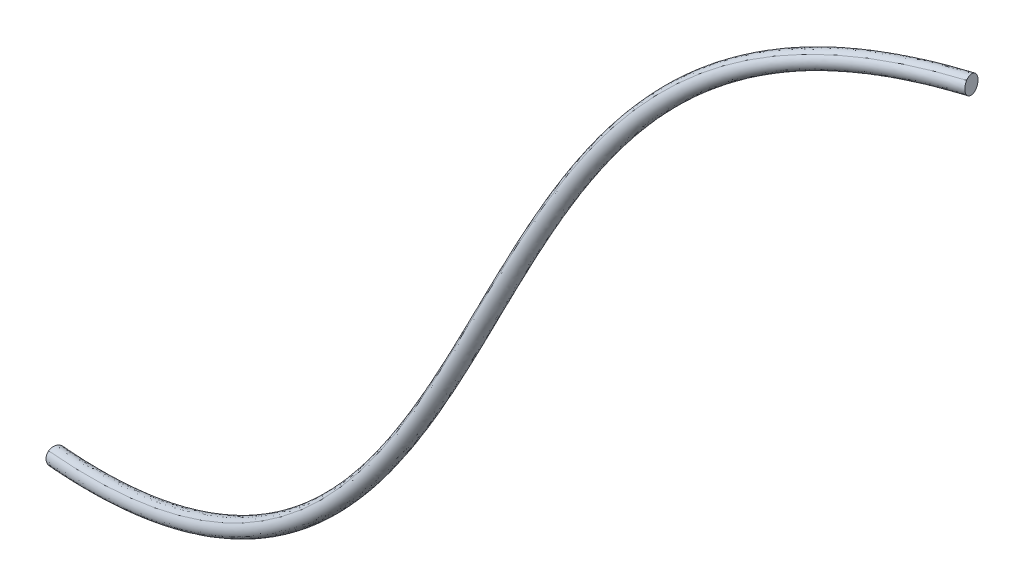
ISO-10303-21;
HEADER;
FILE_DESCRIPTION(('STEP AP214'),'2;1');
FILE_NAME('part.step','',(''),(''),'','','');
FILE_SCHEMA(('AUTOMOTIVE_DESIGN { 1 0 10303 214 1 1 1 1 }'));
ENDSEC;
DATA;
#1=APPLICATION_CONTEXT('core data for automotive mechanical design processes');
#2=APPLICATION_PROTOCOL_DEFINITION('international standard','automotive_design',2000,#1);
#3=PRODUCT_CONTEXT('',#1,'mechanical');
#4=PRODUCT('Part','Part','',(#3));
#5=PRODUCT_RELATED_PRODUCT_CATEGORY('part','',(#4));
#6=PRODUCT_DEFINITION_FORMATION('','',#4);
#7=PRODUCT_DEFINITION_CONTEXT('part definition',#1,'design');
#8=PRODUCT_DEFINITION('design','',#6,#7);
#9=PRODUCT_DEFINITION_SHAPE('','',#8);
#10=(LENGTH_UNIT() NAMED_UNIT(*) SI_UNIT(.MILLI.,.METRE.));
#11=(NAMED_UNIT(*) PLANE_ANGLE_UNIT() SI_UNIT($,.RADIAN.));
#12=(NAMED_UNIT(*) SI_UNIT($,.STERADIAN.) SOLID_ANGLE_UNIT());
#13=UNCERTAINTY_MEASURE_WITH_UNIT(LENGTH_MEASURE(1.E-05),#10,'distance_accuracy_value','');
#14=(GEOMETRIC_REPRESENTATION_CONTEXT(3) GLOBAL_UNCERTAINTY_ASSIGNED_CONTEXT((#13)) GLOBAL_UNIT_ASSIGNED_CONTEXT((#10,
#11,#12)) REPRESENTATION_CONTEXT('',''));
#15=CARTESIAN_POINT('',(0.,0.,0.));
#16=DIRECTION('',(0.,0.,1.));
#17=DIRECTION('',(1.,0.,0.));
#18=AXIS2_PLACEMENT_3D('',#15,#16,#17);
#19=CARTESIAN_POINT('',(-33.6845032303222,79.1480566839275,-95.6289230354739));
#20=CARTESIAN_POINT('',(-34.5053723074152,81.6620351177427,-98.6299372611897));
#21=CARTESIAN_POINT('',(-34.3757825294135,77.3088553118633,-99.6463191124357));
#22=CARTESIAN_POINT('',(-33.5549134521635,74.7948768773692,-96.6453048857477));
#23=CARTESIAN_POINT('',(-32.8636341527265,76.634078248573,-92.6279088079205));
#24=CARTESIAN_POINT('',(-33.6845032303222,79.1480566839275,-95.6289230354739));
#25=CARTESIAN_POINT('',(-37.7318592800201,78.8310864410359,-94.7873765381933));
#26=CARTESIAN_POINT('',(-38.7044746509468,81.3331808071272,-97.7568389162217));
#27=CARTESIAN_POINT('',(-38.3267275887415,76.9994355314687,-98.8248188700412));
#28=CARTESIAN_POINT('',(-37.3541122176295,74.4973411646348,-95.855356491061));
#29=CARTESIAN_POINT('',(-36.7592439084979,76.3289920734125,-91.8179141583467));
#30=CARTESIAN_POINT('',(-37.7318592800201,78.8310864410359,-94.7873765381933));
#31=CARTESIAN_POINT('',(-41.760825570835,78.2100173409345,-93.9371937113666));
#32=CARTESIAN_POINT('',(-42.9084919137163,80.6868683451922,-96.8698561652652));
#33=CARTESIAN_POINT('',(-42.2444636953977,76.3942514519232,-97.9980130548442));
#34=CARTESIAN_POINT('',(-41.0967973481256,73.9174003962123,-95.065350618901));
#35=CARTESIAN_POINT('',(-40.6131592272509,75.7331663351602,-91.0045312556722));
#36=CARTESIAN_POINT('',(-41.760825570835,78.2100173409345,-93.9371937113666));
#37=CARTESIAN_POINT('',(-45.7618018282027,77.2199418263735,-93.0778004639287));
#38=CARTESIAN_POINT('',(-47.1133243003257,79.6518976854315,-95.9670660439208));
#39=CARTESIAN_POINT('',(-46.116016448665,75.4323682697077,-97.1661572660917));
#40=CARTESIAN_POINT('',(-44.7644939754256,73.0004124098136,-94.2768916825047));
#41=CARTESIAN_POINT('',(-44.4102793552521,74.7879859658263,-90.1885348821675));
#42=CARTESIAN_POINT('',(-45.7618018282027,77.2199418263735,-93.0778004639287));
#43=CARTESIAN_POINT('',(-53.1967781559469,74.4198379076141,-91.4408828401396));
#44=CARTESIAN_POINT('',(-54.987926366563,76.6882617787362,-94.2342349442603));
#45=CARTESIAN_POINT('',(-53.2696265324785,72.7341025090626,-95.5905185065432));
#46=CARTESIAN_POINT('',(-51.4784783219654,70.4656786373607,-92.7971664040392));
#47=CARTESIAN_POINT('',(-51.405629944234,72.151414035103,-88.6475307343085));
#48=CARTESIAN_POINT('',(-53.1967781559469,74.4198379076141,-91.4408828401396));
#49=CARTESIAN_POINT('',(-59.7762762705285,69.9124458835433,-89.9214074181916));
#50=CARTESIAN_POINT('',(-61.9924252693158,71.8915873915695,-92.6174733711643));
#51=CARTESIAN_POINT('',(-59.5666811276932,68.4159606416233,-94.1356029362958));
#52=CARTESIAN_POINT('',(-57.3505321275629,66.4368191329065,-91.4395369802412));
#53=CARTESIAN_POINT('',(-57.5601272703842,67.9333043743053,-87.225341463568));
#54=CARTESIAN_POINT('',(-59.7762762705285,69.9124458835433,-89.9214074181916));
#55=CARTESIAN_POINT('',(-62.6384747161083,67.3708941724311,-89.2425990879204));
#56=CARTESIAN_POINT('',(-65.0305938647348,69.1875015695673,-91.8968992124302));
#57=CARTESIAN_POINT('',(-62.3074502175798,65.9841675798163,-93.4855477078927));
#58=CARTESIAN_POINT('',(-59.9153310732129,64.1675601812705,-90.8312475834725));
#59=CARTESIAN_POINT('',(-60.246355566017,65.5542867741826,-86.5882989617852));
#60=CARTESIAN_POINT('',(-62.6384747161083,67.3708941724311,-89.2425990879204));
#61=CARTESIAN_POINT('',(-67.5009949547825,62.0172281365699,-88.0729138003455));
#62=CARTESIAN_POINT('',(-70.1440548385956,63.5501811273866,-90.6658441933193));
#63=CARTESIAN_POINT('',(-66.987207247298,60.8385437512397,-92.360628799866));
#64=CARTESIAN_POINT('',(-64.3441473581608,59.3055907607533,-89.767698405292));
#65=CARTESIAN_POINT('',(-64.857935069351,60.4842751448146,-85.479983405784));
#66=CARTESIAN_POINT('',(-67.5009949547825,62.0172281365699,-88.0729138003455));
#67=CARTESIAN_POINT('',(-71.4720557087035,55.9799943435315,-87.1329947680128));
#68=CARTESIAN_POINT('',(-74.2443546919099,57.3138121060511,-89.6921386574925));
#69=CARTESIAN_POINT('',(-70.8466507689906,54.9850665433518,-91.4495712022842));
#70=CARTESIAN_POINT('',(-68.0743517889575,53.6512487797411,-88.8904273127177));
#71=CARTESIAN_POINT('',(-68.6997567237996,54.6461765801952,-84.573850876966));
#72=CARTESIAN_POINT('',(-71.4720557087035,55.9799943435315,-87.1329947680128));
#73=CARTESIAN_POINT('',(-73.1850031945781,53.0383003549128,-86.7413958319725));
#74=CARTESIAN_POINT('',(-75.9966036597975,54.3049067314083,-89.289840111908));
#75=CARTESIAN_POINT('',(-72.5198535930407,52.1198359821293,-91.0683922128712));
#76=CARTESIAN_POINT('',(-69.7082531296406,50.8532296058757,-88.519947932717));
#77=CARTESIAN_POINT('',(-70.3734027276371,51.7716939776417,-84.1929515504765));
#78=CARTESIAN_POINT('',(-73.1850031945781,53.0383003549128,-86.7413958319725));
#79=CARTESIAN_POINT('',(-76.536731781197,46.7869063065785,-86.0250146919366));
#80=CARTESIAN_POINT('',(-79.399783115895,47.9641322917615,-88.5586944004373));
#81=CARTESIAN_POINT('',(-75.8050396619757,46.0086877838585,-90.3690577452818));
#82=CARTESIAN_POINT('',(-72.9419883235012,44.8314617975262,-87.83537803544));
#83=CARTESIAN_POINT('',(-73.6736804447458,45.6096803206747,-83.4913349818845));
#84=CARTESIAN_POINT('',(-76.536731781197,46.7869063065785,-86.0250146919366));
#85=CARTESIAN_POINT('',(-79.6109495533538,40.4026320531771,-85.5151514735015));
#86=CARTESIAN_POINT('',(-82.469482798476,41.5922965520514,-88.047390366344));
#87=CARTESIAN_POINT('',(-78.8353684553753,39.7274610551557,-89.8679530440442));
#88=CARTESIAN_POINT('',(-75.9768352126377,38.5377965566711,-87.3357141511));
#89=CARTESIAN_POINT('',(-76.7524163064813,39.2129675535743,-82.9829125791085));
#90=CARTESIAN_POINT('',(-79.6109495533538,40.4026320531771,-85.5151514735015));
#91=CARTESIAN_POINT('',(-81.2020489152879,37.0573967606762,-85.3032791011795));
#92=CARTESIAN_POINT('',(-84.0458726875682,38.2795125657242,-87.8375263156273));
#93=CARTESIAN_POINT('',(-80.4058935790862,36.427115088456,-89.6589328742075));
#94=CARTESIAN_POINT('',(-77.5620698057757,35.2049992844572,-87.1246856579405));
#95=CARTESIAN_POINT('',(-78.3582251412662,35.8352809548799,-82.76903188518));
#96=CARTESIAN_POINT('',(-81.2020489152879,37.0573967606762,-85.3032791011795));
#97=CARTESIAN_POINT('',(-84.6021600073528,30.0896558093534,-84.9760687249549));
#98=CARTESIAN_POINT('',(-87.3863254709585,31.4309928202342,-87.5200980553603));
#99=CARTESIAN_POINT('',(-83.7627378384492,29.5368746726278,-89.334236661248));
#100=CARTESIAN_POINT('',(-80.9785723742065,28.1955376597728,-86.7902073310605));
#101=CARTESIAN_POINT('',(-81.8179945420423,28.7483187976512,-82.4320393929918));
#102=CARTESIAN_POINT('',(-84.6021600073528,30.0896558093534,-84.9760687249549));
#103=CARTESIAN_POINT('',(-88.338580293266,23.3124406707113,-84.9080610109557));
#104=CARTESIAN_POINT('',(-90.990374671308,24.8662856953991,-87.4736312577017));
#105=CARTESIAN_POINT('',(-87.4466836169637,22.8009470679924,-89.2605816296007));
#106=CARTESIAN_POINT('',(-84.7948892378617,21.2471020446523,-86.695011380895));
#107=CARTESIAN_POINT('',(-85.6867859136002,21.758595645072,-82.3424907626387));
#108=CARTESIAN_POINT('',(-88.338580293266,23.3124406707113,-84.9080610109557));
#109=CARTESIAN_POINT('',(-90.4437843932474,19.8507125766429,-84.9478842998231));
#110=CARTESIAN_POINT('',(-93.0029159547427,21.5372305523186,-87.5279681740075));
#111=CARTESIAN_POINT('',(-89.519389211958,19.3506651775969,-89.2949677165145));
#112=CARTESIAN_POINT('',(-86.9602576482985,17.6641471995422,-86.7148838383625));
#113=CARTESIAN_POINT('',(-87.884652830185,18.1641945999345,-82.3678004240588));
#114=CARTESIAN_POINT('',(-90.4437843932474,19.8507125766429,-84.9478842998231));
#115=CARTESIAN_POINT('',(-95.4858524735816,12.5499389351737,-85.2166070464577));
#116=CARTESIAN_POINT('',(-97.7737679470863,14.5597152609863,-87.8367975029275));
#117=CARTESIAN_POINT('',(-94.4752459501862,12.043706270219,-89.544419988054));
#118=CARTESIAN_POINT('',(-92.187330477695,10.0339299459518,-86.924229534588));
#119=CARTESIAN_POINT('',(-93.197936998676,10.5401626081305,-82.5964165883835));
#120=CARTESIAN_POINT('',(-95.4858524735816,12.5499389351737,-85.2166070464577));
#121=CARTESIAN_POINT('',(-101.557276887098,6.12770272325862,-85.9000100443528));
#122=CARTESIAN_POINT('',(-103.426450048395,8.46719266417557,-88.5774344865732));
#123=CARTESIAN_POINT('',(-100.443444023573,5.52829260011018,-90.190690361982));
#124=CARTESIAN_POINT('',(-98.57427085965,3.18880265572066,-87.51326591427));
#125=CARTESIAN_POINT('',(-99.6881037246567,3.78821278090915,-83.222585600493));
#126=CARTESIAN_POINT('',(-101.557276887098,6.12770272325862,-85.9000100443528));
#127=CARTESIAN_POINT('',(-105.18643098945,2.99462321745921,-86.399333386397));
#128=CARTESIAN_POINT('',(-106.783822140051,5.49119854572251,-89.1126506556722));
#129=CARTESIAN_POINT('',(-104.016824647343,2.31116485157093,-90.663787437363));
#130=CARTESIAN_POINT('',(-102.41943349694,-0.185410480765234,-87.9504701719255));
#131=CARTESIAN_POINT('',(-103.589039837871,0.498047887667206,-83.6860161154602));
#132=CARTESIAN_POINT('',(-105.18643098945,2.99462321745921,-86.399333386397));
#133=CARTESIAN_POINT('',(-113.736288937573,-2.93320381253314,-87.7448420434316));
#134=CARTESIAN_POINT('',(-114.713775389148,-0.198621524594232,-90.5400665054792));
#135=CARTESIAN_POINT('',(-112.486966536521,-3.85820577370835,-91.9437936616002));
#136=CARTESIAN_POINT('',(-111.509480083745,-6.59278805862435,-89.1485691931843));
#137=CARTESIAN_POINT('',(-112.7588024854,-5.66778610214648,-84.9496175796725));
#138=CARTESIAN_POINT('',(-113.736288937573,-2.93320381253314,-87.7448420434316));
#139=CARTESIAN_POINT('',(-123.298245146726,-6.90919527936296,-89.5424167310865));
#140=CARTESIAN_POINT('',(-123.704508284976,-4.13115469502926,-92.4152003194287));
#141=CARTESIAN_POINT('',(-122.066544831865,-8.1240645470182,-93.671231850911));
#142=CARTESIAN_POINT('',(-121.660281694491,-10.902105136731,-90.798448268206));
#143=CARTESIAN_POINT('',(-122.891982008228,-9.6872358653977,-86.6696331409852));
#144=CARTESIAN_POINT('',(-123.298245146726,-6.90919527936296,-89.5424167310865));
#145=CARTESIAN_POINT('',(-128.667435860088,-8.50855457830133,-90.6154171100554));
#146=CARTESIAN_POINT('',(-128.814248543664,-5.75317971598601,-93.5248808505925));
#147=CARTESIAN_POINT('',(-127.475814982872,-9.86865982714717,-94.7093372125007));
#148=CARTESIAN_POINT('',(-127.329002728242,-12.6240346020668,-91.7998737252012));
#149=CARTESIAN_POINT('',(-128.520623176422,-11.2639294423038,-87.7059533677368));
#150=CARTESIAN_POINT('',(-128.667435860088,-8.50855457830133,-90.6154171100554));
#151=CARTESIAN_POINT('',(-134.105809849165,-9.65339172389189,-91.7494854477227));
#152=CARTESIAN_POINT('',(-134.037210039855,-6.93632633400947,-94.6903035931578));
#153=CARTESIAN_POINT('',(-132.96527756936,-11.1379788671982,-95.8128077389448));
#154=CARTESIAN_POINT('',(-133.033877378711,-13.8550442577368,-92.871989592136));
#155=CARTESIAN_POINT('',(-134.174409658518,-12.370457115438,-88.8086673004868));
#156=CARTESIAN_POINT('',(-134.105809849165,-9.65339172389189,-91.7494854477227));
#157=CARTESIAN_POINT('',(-139.591278713323,-10.4198352991101,-92.9316734146425));
#158=CARTESIAN_POINT('',(-139.342045289605,-7.74969172886707,-95.8995372937403));
#159=CARTESIAN_POINT('',(-138.507652980239,-12.011376874184,-96.9681013751895));
#160=CARTESIAN_POINT('',(-138.756886403987,-14.6815204452339,-94.0002374951395));
#161=CARTESIAN_POINT('',(-139.840512137193,-13.0899788709881,-89.9638095337275));
#162=CARTESIAN_POINT('',(-139.591278713323,-10.4198352991101,-92.9316734146425));
#163=(BOUNDED_SURFACE() B_SPLINE_SURFACE(5,5,((#19,#20,#21,#22,#23,#24),(#25,#26,#27,#28,#29,
#30),(#31,#32,#33,#34,#35,#36),(#37,#38,#39,#40,#41,#42),(#43,#44,#45,#46,#47,#48),(#49,#50,#51,
#52,#53,#54),(#55,#56,#57,#58,#59,#60),(#61,#62,#63,#64,#65,#66),(#67,#68,#69,#70,#71,#72),(#73,
#74,#75,#76,#77,#78),(#79,#80,#81,#82,#83,#84),(#85,#86,#87,#88,#89,#90),(#91,#92,#93,#94,#95,
#96),(#97,#98,#99,#100,#101,#102),(#103,#104,#105,#106,#107,#108),(#109,#110,#111,#112,#113,
#114),(#115,#116,#117,#118,#119,#120),(#121,#122,#123,#124,#125,#126),(#127,#128,#129,#130,#131,
#132),(#133,#134,#135,#136,#137,#138),(#139,#140,#141,#142,#143,#144),(#145,#146,#147,#148,#149,
#150),(#151,#152,#153,#154,#155,#156),(#157,#158,#159,#160,#161,#162)),.UNSPECIFIED.,.F.,.T.,
.F.) B_SPLINE_SURFACE_WITH_KNOTS((6,3,3,3,3,3,3,6),(6,6),(0.,0.138277050661301,
0.266421728428524,0.38022589964879,0.505230602834062,0.642421974870507,0.806785834234992,1.),
(0.,1.),.UNSPECIFIED.) GEOMETRIC_REPRESENTATION_ITEM() RATIONAL_B_SPLINE_SURFACE(((1.,0.2,0.2,
0.2,0.2,1.),(1.,0.2,0.2,0.2,0.2,1.),(1.,0.2,0.2,0.2,0.2,1.),(1.,0.2,0.2,0.2,0.2,1.),(1.,0.2,0.2,
0.2,0.2,1.),(1.,0.2,0.2,0.2,0.2,1.),(1.,0.2,0.2,0.2,0.2,1.),(1.,0.2,0.2,0.2,0.2,1.),(1.,0.2,0.2,
0.2,0.2,1.),(1.,0.2,0.2,0.2,0.2,1.),(1.,0.2,0.2,0.2,0.2,1.),(1.,0.2,0.2,0.2,0.2,1.),(1.,0.2,0.2,
0.2,0.2,1.),(1.,0.2,0.2,0.2,0.2,1.),(1.,0.2,0.2,0.2,0.2,1.),(1.,0.2,0.2,0.2,0.2,1.),(1.,0.2,0.2,
0.2,0.2,1.),(1.,0.2,0.2,0.2,0.2,1.),(1.,0.2,0.2,0.2,0.2,1.),(1.,0.2,0.2,0.2,0.2,1.),(1.,0.2,0.2,
0.2,0.2,1.),(1.,0.2,0.2,0.2,0.2,1.),(1.,0.2,0.2,0.2,0.2,1.),(1.,0.2,0.2,0.2,0.2,1.))) REPRESENTATION_ITEM('') SURFACE());
#164=CARTESIAN_POINT('',(-139.591278713353,-10.4198352999419,-92.9316734137214));
#165=CARTESIAN_POINT('',(-134.105809849438,-9.65339172462634,-91.7494854467776));
#166=CARTESIAN_POINT('',(-128.667435824498,-8.50855449774803,-90.6154170649766));
#167=CARTESIAN_POINT('',(-123.298245147785,-6.90919527819959,-89.5424167285132));
#168=CARTESIAN_POINT('',(-113.736288936218,-2.93320381505569,-87.7448420440228));
#169=CARTESIAN_POINT('',(-105.186430989873,2.99462321815039,-86.3993333843165));
#170=CARTESIAN_POINT('',(-101.557276885727,6.12770272272741,-85.9000100460925));
#171=CARTESIAN_POINT('',(-95.4858524734683,12.5499389343762,-85.2166070434773));
#172=CARTESIAN_POINT('',(-90.4437843919303,19.8507125762994,-84.9478843008213));
#173=CARTESIAN_POINT('',(-88.3385802922195,23.3124406711138,-84.9080610100336));
#174=CARTESIAN_POINT('',(-84.602160006735,30.0896558080645,-84.9760687243127));
#175=CARTESIAN_POINT('',(-81.2020489142007,37.0573967611127,-85.3032791002773));
#176=CARTESIAN_POINT('',(-79.6109495515742,40.4026320522799,-85.5151514722814));
#177=CARTESIAN_POINT('',(-76.5367317811975,46.7869063067004,-86.0250146915647));
#178=CARTESIAN_POINT('',(-73.1850031929696,53.0383003541039,-86.7413958308399));
#179=CARTESIAN_POINT('',(-71.4720557081354,55.9799943431743,-87.1329947661253));
#180=CARTESIAN_POINT('',(-67.500994953706,62.0172281360285,-88.072913800831));
#181=CARTESIAN_POINT('',(-62.6384747157347,67.37089417194,-89.2425990856969));
#182=CARTESIAN_POINT('',(-59.7762762689561,69.9124458817836,-89.9214074171941));
#183=CARTESIAN_POINT('',(-53.1967781563206,74.4198379081552,-91.4408828394583));
#184=CARTESIAN_POINT('',(-45.7618018267741,77.2199418243646,-93.0778004628453));
#185=CARTESIAN_POINT('',(-41.760825550168,78.2100173433498,-93.9371937267391));
#186=CARTESIAN_POINT('',(-37.7318592796099,78.8310864402465,-94.787376537327));
#187=CARTESIAN_POINT('',(-33.6845032300708,79.148056683158,-95.6289230345552));
#188=B_SPLINE_CURVE_WITH_KNOTS('',5,(#164,#165,#166,#167,#168,#169,#170,#171,#172,#173,#174,
#175,#176,#177,#178,#179,#180,#181,#182,#183,#184,#185,#186,#187),.UNSPECIFIED.,.F.,.F.,(6,3,3,
3,3,3,3,6),(0.,0.193214165765008,0.357578025129493,0.494769397165938,0.619774100351211,
0.733578271571476,0.861722949338699,1.),.UNSPECIFIED.);
#189=CARTESIAN_POINT('',(-139.591278713353,-10.4198352999419,-92.9316734137214));
#190=VERTEX_POINT('',#189);
#191=CARTESIAN_POINT('',(-33.6845032300708,79.148056683158,-95.6289230345552));
#192=VERTEX_POINT('',#191);
#193=EDGE_CURVE('E11',#190,#192,#188,.T.);
#194=CARTESIAN_POINT('',(-33.7547144202503,78.3740090360228,-96.2581452756896));
#195=DIRECTION('',(-0.976194786475636,-0.0764510749785592,0.202975298971108));
#196=DIRECTION('',(0.187800285035442,-0.766115698383431,0.61465257636414));
#197=AXIS2_PLACEMENT_3D('',#194,#195,#196);
#198=CIRCLE('',#197,1.00000000000007);
#199=CARTESIAN_POINT('',(-33.8249256104193,77.5999613888741,-96.8873675168769));
#200=VERTEX_POINT('',#199);
#201=EDGE_CURVE('E27',#192,#200,#198,.T.);
#202=CARTESIAN_POINT('',(-139.111774202723,-11.8831419798104,-94.2079214244611));
#203=CARTESIAN_POINT('',(-133.552693661663,-11.0749516434941,-93.0459420561738));
#204=CARTESIAN_POINT('',(-128.034922348896,-9.8774508765196,-91.9350112779182));
#205=CARTESIAN_POINT('',(-122.580829205198,-8.21114006057406,-90.8886283944009));
#206=CARTESIAN_POINT('',(-112.867256123406,-4.07935036519421,-89.1455117353734));
#207=CARTESIAN_POINT('',(-104.202280030712,2.02875020142864,-87.853231094772));
#208=CARTESIAN_POINT('',(-100.533067163858,5.24312517527158,-87.3759940914662));
#209=CARTESIAN_POINT('',(-94.4085703435564,11.7943785212857,-86.7254659028872));
#210=CARTESIAN_POINT('',(-89.3418039111579,19.1790593824004,-86.47640503869));
#211=CARTESIAN_POINT('',(-87.2296833598145,22.6682326135193,-86.4429287576741));
#212=CARTESIAN_POINT('',(-83.4864075564537,29.4779309873123,-86.5191453602153));
#213=CARTESIAN_POINT('',(-80.093015303403,36.4367269735865,-86.8475441831796));
#214=CARTESIAN_POINT('',(-78.5085256930817,39.7676304292078,-87.0584925350218));
#215=CARTESIAN_POINT('',(-75.455122886723,46.1034905485313,-87.5636162908578));
#216=CARTESIAN_POINT('',(-72.1495282773207,52.2624165741642,-88.2677829518772));
#217=CARTESIAN_POINT('',(-70.4662784935541,55.1490760023689,-88.6514970121077));
#218=CARTESIAN_POINT('',(-66.5833361282741,61.044647696033,-89.5685387013708));
#219=CARTESIAN_POINT('',(-61.8749326804326,66.2233790262322,-90.7004983660949));
#220=CARTESIAN_POINT('',(-59.1174414485109,68.6694178847536,-91.3544886877591));
#221=CARTESIAN_POINT('',(-52.7854152914929,73.00986424043,-92.8173626472945));
#222=CARTESIAN_POINT('',(-45.6010285197348,75.7181660823459,-94.3996624686449));
#223=CARTESIAN_POINT('',(-41.7157280410826,76.6829216329697,-95.2344377777823));
#224=CARTESIAN_POINT('',(-37.7861395914676,77.2897373941862,-96.0637321089382));
#225=CARTESIAN_POINT('',(-33.8249256104193,77.5999613888741,-96.8873675168769));
#226=B_SPLINE_CURVE_WITH_KNOTS('',5,(#202,#203,#204,#205,#206,#207,#208,#209,#210,#211,#212,
#213,#214,#215,#216,#217,#218,#219,#220,#221,#222,#223,#224,#225),.UNSPECIFIED.,.F.,.F.,(6,3,3,
3,3,3,3,6),(0.,0.193214165765008,0.357578025129493,0.494769397165938,0.619774100351211,
0.733578271571476,0.861722949338699,1.),.UNSPECIFIED.);
#227=CARTESIAN_POINT('',(-139.111774202723,-11.8831419798104,-94.2079214244611));
#228=VERTEX_POINT('',#227);
#229=EDGE_CURVE('E49',#228,#200,#226,.T.);
#230=CARTESIAN_POINT('',(-139.351526458078,-11.1514886398824,-93.569797419081));
#231=DIRECTION('',(-0.96883255769387,-0.138127557017047,-0.205631352533744));
#232=DIRECTION('',(-0.0206696644511185,-0.782135992370261,0.622764846800512));
#233=AXIS2_PLACEMENT_3D('',#230,#231,#232);
#234=CIRCLE('',#233,0.999999999999298);
#235=EDGE_CURVE('E42',#190,#228,#234,.T.);
#236=ORIENTED_EDGE('',*,*,#193,.T.);
#237=ORIENTED_EDGE('',*,*,#201,.T.);
#238=ORIENTED_EDGE('',*,*,#229,.F.);
#239=ORIENTED_EDGE('',*,*,#235,.F.);
#240=EDGE_LOOP('',(#236,#237,#238,#239));
#241=FACE_BOUND('',#240,.T.);
#242=ADVANCED_FACE('F17',(#241),#163,.F.);
#243=CARTESIAN_POINT('',(-33.6845032303222,79.1480566839275,-95.6289230354739));
#244=CARTESIAN_POINT('',(-34.5053723074152,81.6620351177427,-98.6299372611897));
#245=CARTESIAN_POINT('',(-34.3757825294135,77.3088553118633,-99.6463191124357));
#246=CARTESIAN_POINT('',(-33.5549134521635,74.7948768773692,-96.6453048857477));
#247=CARTESIAN_POINT('',(-32.8636341527265,76.634078248573,-92.6279088079205));
#248=CARTESIAN_POINT('',(-33.6845032303222,79.1480566839275,-95.6289230354739));
#249=CARTESIAN_POINT('',(-37.7318592800201,78.8310864410359,-94.7873765381933));
#250=CARTESIAN_POINT('',(-38.7044746509468,81.3331808071272,-97.7568389162217));
#251=CARTESIAN_POINT('',(-38.3267275887415,76.9994355314687,-98.8248188700412));
#252=CARTESIAN_POINT('',(-37.3541122176295,74.4973411646348,-95.855356491061));
#253=CARTESIAN_POINT('',(-36.7592439084979,76.3289920734125,-91.8179141583467));
#254=CARTESIAN_POINT('',(-37.7318592800201,78.8310864410359,-94.7873765381933));
#255=CARTESIAN_POINT('',(-41.760825570835,78.2100173409345,-93.9371937113666));
#256=CARTESIAN_POINT('',(-42.9084919137163,80.6868683451922,-96.8698561652652));
#257=CARTESIAN_POINT('',(-42.2444636953977,76.3942514519232,-97.9980130548442));
#258=CARTESIAN_POINT('',(-41.0967973481256,73.9174003962123,-95.065350618901));
#259=CARTESIAN_POINT('',(-40.6131592272509,75.7331663351602,-91.0045312556722));
#260=CARTESIAN_POINT('',(-41.760825570835,78.2100173409345,-93.9371937113666));
#261=CARTESIAN_POINT('',(-45.7618018282027,77.2199418263735,-93.0778004639287));
#262=CARTESIAN_POINT('',(-47.1133243003257,79.6518976854315,-95.9670660439208));
#263=CARTESIAN_POINT('',(-46.116016448665,75.4323682697077,-97.1661572660917));
#264=CARTESIAN_POINT('',(-44.7644939754256,73.0004124098136,-94.2768916825047));
#265=CARTESIAN_POINT('',(-44.4102793552521,74.7879859658263,-90.1885348821675));
#266=CARTESIAN_POINT('',(-45.7618018282027,77.2199418263735,-93.0778004639287));
#267=CARTESIAN_POINT('',(-53.1967781559469,74.4198379076141,-91.4408828401396));
#268=CARTESIAN_POINT('',(-54.987926366563,76.6882617787362,-94.2342349442603));
#269=CARTESIAN_POINT('',(-53.2696265324785,72.7341025090626,-95.5905185065432));
#270=CARTESIAN_POINT('',(-51.4784783219654,70.4656786373607,-92.7971664040392));
#271=CARTESIAN_POINT('',(-51.405629944234,72.151414035103,-88.6475307343085));
#272=CARTESIAN_POINT('',(-53.1967781559469,74.4198379076141,-91.4408828401396));
#273=CARTESIAN_POINT('',(-59.7762762705285,69.9124458835433,-89.9214074181916));
#274=CARTESIAN_POINT('',(-61.9924252693158,71.8915873915695,-92.6174733711643));
#275=CARTESIAN_POINT('',(-59.5666811276932,68.4159606416233,-94.1356029362958));
#276=CARTESIAN_POINT('',(-57.3505321275629,66.4368191329065,-91.4395369802412));
#277=CARTESIAN_POINT('',(-57.5601272703842,67.9333043743053,-87.225341463568));
#278=CARTESIAN_POINT('',(-59.7762762705285,69.9124458835433,-89.9214074181916));
#279=CARTESIAN_POINT('',(-62.6384747161083,67.3708941724311,-89.2425990879204));
#280=CARTESIAN_POINT('',(-65.0305938647348,69.1875015695673,-91.8968992124302));
#281=CARTESIAN_POINT('',(-62.3074502175798,65.9841675798163,-93.4855477078927));
#282=CARTESIAN_POINT('',(-59.9153310732129,64.1675601812705,-90.8312475834725));
#283=CARTESIAN_POINT('',(-60.246355566017,65.5542867741826,-86.5882989617852));
#284=CARTESIAN_POINT('',(-62.6384747161083,67.3708941724311,-89.2425990879204));
#285=CARTESIAN_POINT('',(-67.5009949547825,62.0172281365699,-88.0729138003455));
#286=CARTESIAN_POINT('',(-70.1440548385956,63.5501811273866,-90.6658441933193));
#287=CARTESIAN_POINT('',(-66.987207247298,60.8385437512397,-92.360628799866));
#288=CARTESIAN_POINT('',(-64.3441473581608,59.3055907607533,-89.767698405292));
#289=CARTESIAN_POINT('',(-64.857935069351,60.4842751448146,-85.479983405784));
#290=CARTESIAN_POINT('',(-67.5009949547825,62.0172281365699,-88.0729138003455));
#291=CARTESIAN_POINT('',(-71.4720557087035,55.9799943435315,-87.1329947680128));
#292=CARTESIAN_POINT('',(-74.2443546919099,57.3138121060511,-89.6921386574925));
#293=CARTESIAN_POINT('',(-70.8466507689906,54.9850665433518,-91.4495712022842));
#294=CARTESIAN_POINT('',(-68.0743517889575,53.6512487797411,-88.8904273127177));
#295=CARTESIAN_POINT('',(-68.6997567237996,54.6461765801952,-84.573850876966));
#296=CARTESIAN_POINT('',(-71.4720557087035,55.9799943435315,-87.1329947680128));
#297=CARTESIAN_POINT('',(-73.1850031945781,53.0383003549128,-86.7413958319725));
#298=CARTESIAN_POINT('',(-75.9966036597975,54.3049067314083,-89.289840111908));
#299=CARTESIAN_POINT('',(-72.5198535930407,52.1198359821293,-91.0683922128712));
#300=CARTESIAN_POINT('',(-69.7082531296406,50.8532296058757,-88.519947932717));
#301=CARTESIAN_POINT('',(-70.3734027276371,51.7716939776417,-84.1929515504765));
#302=CARTESIAN_POINT('',(-73.1850031945781,53.0383003549128,-86.7413958319725));
#303=CARTESIAN_POINT('',(-76.536731781197,46.7869063065785,-86.0250146919366));
#304=CARTESIAN_POINT('',(-79.399783115895,47.9641322917615,-88.5586944004373));
#305=CARTESIAN_POINT('',(-75.8050396619757,46.0086877838585,-90.3690577452818));
#306=CARTESIAN_POINT('',(-72.9419883235012,44.8314617975262,-87.83537803544));
#307=CARTESIAN_POINT('',(-73.6736804447458,45.6096803206747,-83.4913349818845));
#308=CARTESIAN_POINT('',(-76.536731781197,46.7869063065785,-86.0250146919366));
#309=CARTESIAN_POINT('',(-79.6109495533538,40.4026320531771,-85.5151514735015));
#310=CARTESIAN_POINT('',(-82.469482798476,41.5922965520514,-88.047390366344));
#311=CARTESIAN_POINT('',(-78.8353684553753,39.7274610551557,-89.8679530440442));
#312=CARTESIAN_POINT('',(-75.9768352126377,38.5377965566711,-87.3357141511));
#313=CARTESIAN_POINT('',(-76.7524163064813,39.2129675535743,-82.9829125791085));
#314=CARTESIAN_POINT('',(-79.6109495533538,40.4026320531771,-85.5151514735015));
#315=CARTESIAN_POINT('',(-81.2020489152879,37.0573967606762,-85.3032791011795));
#316=CARTESIAN_POINT('',(-84.0458726875682,38.2795125657242,-87.8375263156273));
#317=CARTESIAN_POINT('',(-80.4058935790862,36.427115088456,-89.6589328742075));
#318=CARTESIAN_POINT('',(-77.5620698057757,35.2049992844572,-87.1246856579405));
#319=CARTESIAN_POINT('',(-78.3582251412662,35.8352809548799,-82.76903188518));
#320=CARTESIAN_POINT('',(-81.2020489152879,37.0573967606762,-85.3032791011795));
#321=CARTESIAN_POINT('',(-84.6021600073528,30.0896558093534,-84.9760687249549));
#322=CARTESIAN_POINT('',(-87.3863254709585,31.4309928202342,-87.5200980553603));
#323=CARTESIAN_POINT('',(-83.7627378384492,29.5368746726278,-89.334236661248));
#324=CARTESIAN_POINT('',(-80.9785723742065,28.1955376597728,-86.7902073310605));
#325=CARTESIAN_POINT('',(-81.8179945420423,28.7483187976512,-82.4320393929918));
#326=CARTESIAN_POINT('',(-84.6021600073528,30.0896558093534,-84.9760687249549));
#327=CARTESIAN_POINT('',(-88.338580293266,23.3124406707113,-84.9080610109557));
#328=CARTESIAN_POINT('',(-90.990374671308,24.8662856953991,-87.4736312577017));
#329=CARTESIAN_POINT('',(-87.4466836169637,22.8009470679924,-89.2605816296007));
#330=CARTESIAN_POINT('',(-84.7948892378617,21.2471020446523,-86.695011380895));
#331=CARTESIAN_POINT('',(-85.6867859136002,21.758595645072,-82.3424907626387));
#332=CARTESIAN_POINT('',(-88.338580293266,23.3124406707113,-84.9080610109557));
#333=CARTESIAN_POINT('',(-90.4437843932474,19.8507125766429,-84.9478842998231));
#334=CARTESIAN_POINT('',(-93.0029159547427,21.5372305523186,-87.5279681740075));
#335=CARTESIAN_POINT('',(-89.519389211958,19.3506651775969,-89.2949677165145));
#336=CARTESIAN_POINT('',(-86.9602576482985,17.6641471995422,-86.7148838383625));
#337=CARTESIAN_POINT('',(-87.884652830185,18.1641945999345,-82.3678004240588));
#338=CARTESIAN_POINT('',(-90.4437843932474,19.8507125766429,-84.9478842998231));
#339=CARTESIAN_POINT('',(-95.4858524735816,12.5499389351737,-85.2166070464577));
#340=CARTESIAN_POINT('',(-97.7737679470863,14.5597152609863,-87.8367975029275));
#341=CARTESIAN_POINT('',(-94.4752459501862,12.043706270219,-89.544419988054));
#342=CARTESIAN_POINT('',(-92.187330477695,10.0339299459518,-86.924229534588));
#343=CARTESIAN_POINT('',(-93.197936998676,10.5401626081305,-82.5964165883835));
#344=CARTESIAN_POINT('',(-95.4858524735816,12.5499389351737,-85.2166070464577));
#345=CARTESIAN_POINT('',(-101.557276887098,6.12770272325862,-85.9000100443528));
#346=CARTESIAN_POINT('',(-103.426450048395,8.46719266417557,-88.5774344865732));
#347=CARTESIAN_POINT('',(-100.443444023573,5.52829260011018,-90.190690361982));
#348=CARTESIAN_POINT('',(-98.57427085965,3.18880265572066,-87.51326591427));
#349=CARTESIAN_POINT('',(-99.6881037246567,3.78821278090915,-83.222585600493));
#350=CARTESIAN_POINT('',(-101.557276887098,6.12770272325862,-85.9000100443528));
#351=CARTESIAN_POINT('',(-105.18643098945,2.99462321745921,-86.399333386397));
#352=CARTESIAN_POINT('',(-106.783822140051,5.49119854572251,-89.1126506556722));
#353=CARTESIAN_POINT('',(-104.016824647343,2.31116485157093,-90.663787437363));
#354=CARTESIAN_POINT('',(-102.41943349694,-0.185410480765234,-87.9504701719255));
#355=CARTESIAN_POINT('',(-103.589039837871,0.498047887667206,-83.6860161154602));
#356=CARTESIAN_POINT('',(-105.18643098945,2.99462321745921,-86.399333386397));
#357=CARTESIAN_POINT('',(-113.736288937573,-2.93320381253314,-87.7448420434316));
#358=CARTESIAN_POINT('',(-114.713775389148,-0.198621524594232,-90.5400665054792));
#359=CARTESIAN_POINT('',(-112.486966536521,-3.85820577370835,-91.9437936616002));
#360=CARTESIAN_POINT('',(-111.509480083745,-6.59278805862435,-89.1485691931843));
#361=CARTESIAN_POINT('',(-112.7588024854,-5.66778610214648,-84.9496175796725));
#362=CARTESIAN_POINT('',(-113.736288937573,-2.93320381253314,-87.7448420434316));
#363=CARTESIAN_POINT('',(-123.298245146726,-6.90919527936296,-89.5424167310865));
#364=CARTESIAN_POINT('',(-123.704508284976,-4.13115469502926,-92.4152003194287));
#365=CARTESIAN_POINT('',(-122.066544831865,-8.1240645470182,-93.671231850911));
#366=CARTESIAN_POINT('',(-121.660281694491,-10.902105136731,-90.798448268206));
#367=CARTESIAN_POINT('',(-122.891982008228,-9.6872358653977,-86.6696331409852));
#368=CARTESIAN_POINT('',(-123.298245146726,-6.90919527936296,-89.5424167310865));
#369=CARTESIAN_POINT('',(-128.667435860088,-8.50855457830133,-90.6154171100554));
#370=CARTESIAN_POINT('',(-128.814248543664,-5.75317971598601,-93.5248808505925));
#371=CARTESIAN_POINT('',(-127.475814982872,-9.86865982714717,-94.7093372125007));
#372=CARTESIAN_POINT('',(-127.329002728242,-12.6240346020668,-91.7998737252012));
#373=CARTESIAN_POINT('',(-128.520623176422,-11.2639294423038,-87.7059533677368));
#374=CARTESIAN_POINT('',(-128.667435860088,-8.50855457830133,-90.6154171100554));
#375=CARTESIAN_POINT('',(-134.105809849165,-9.65339172389189,-91.7494854477227));
#376=CARTESIAN_POINT('',(-134.037210039855,-6.93632633400947,-94.6903035931578));
#377=CARTESIAN_POINT('',(-132.96527756936,-11.1379788671982,-95.8128077389448));
#378=CARTESIAN_POINT('',(-133.033877378711,-13.8550442577368,-92.871989592136));
#379=CARTESIAN_POINT('',(-134.174409658518,-12.370457115438,-88.8086673004868));
#380=CARTESIAN_POINT('',(-134.105809849165,-9.65339172389189,-91.7494854477227));
#381=CARTESIAN_POINT('',(-139.591278713323,-10.4198352991101,-92.9316734146425));
#382=CARTESIAN_POINT('',(-139.342045289605,-7.74969172886707,-95.8995372937403));
#383=CARTESIAN_POINT('',(-138.507652980239,-12.011376874184,-96.9681013751895));
#384=CARTESIAN_POINT('',(-138.756886403987,-14.6815204452339,-94.0002374951395));
#385=CARTESIAN_POINT('',(-139.840512137193,-13.0899788709881,-89.9638095337275));
#386=CARTESIAN_POINT('',(-139.591278713323,-10.4198352991101,-92.9316734146425));
#387=(BOUNDED_SURFACE() B_SPLINE_SURFACE(5,5,((#243,#244,#245,#246,#247,#248),(#249,#250,#251,
#252,#253,#254),(#255,#256,#257,#258,#259,#260),(#261,#262,#263,#264,#265,#266),(#267,#268,#269,
#270,#271,#272),(#273,#274,#275,#276,#277,#278),(#279,#280,#281,#282,#283,#284),(#285,#286,#287,
#288,#289,#290),(#291,#292,#293,#294,#295,#296),(#297,#298,#299,#300,#301,#302),(#303,#304,#305,
#306,#307,#308),(#309,#310,#311,#312,#313,#314),(#315,#316,#317,#318,#319,#320),(#321,#322,#323,
#324,#325,#326),(#327,#328,#329,#330,#331,#332),(#333,#334,#335,#336,#337,#338),(#339,#340,#341,
#342,#343,#344),(#345,#346,#347,#348,#349,#350),(#351,#352,#353,#354,#355,#356),(#357,#358,#359,
#360,#361,#362),(#363,#364,#365,#366,#367,#368),(#369,#370,#371,#372,#373,#374),(#375,#376,#377,
#378,#379,#380),(#381,#382,#383,#384,#385,#386)),.UNSPECIFIED.,.F.,.T.,
.F.) B_SPLINE_SURFACE_WITH_KNOTS((6,3,3,3,3,3,3,6),(6,6),(0.,0.138277050661301,
0.266421728428524,0.38022589964879,0.505230602834062,0.642421974870507,0.806785834234992,1.),
(0.,1.),.UNSPECIFIED.) GEOMETRIC_REPRESENTATION_ITEM() RATIONAL_B_SPLINE_SURFACE(((1.,0.2,0.2,
0.2,0.2,1.),(1.,0.2,0.2,0.2,0.2,1.),(1.,0.2,0.2,0.2,0.2,1.),(1.,0.2,0.2,0.2,0.2,1.),(1.,0.2,0.2,
0.2,0.2,1.),(1.,0.2,0.2,0.2,0.2,1.),(1.,0.2,0.2,0.2,0.2,1.),(1.,0.2,0.2,0.2,0.2,1.),(1.,0.2,0.2,
0.2,0.2,1.),(1.,0.2,0.2,0.2,0.2,1.),(1.,0.2,0.2,0.2,0.2,1.),(1.,0.2,0.2,0.2,0.2,1.),(1.,0.2,0.2,
0.2,0.2,1.),(1.,0.2,0.2,0.2,0.2,1.),(1.,0.2,0.2,0.2,0.2,1.),(1.,0.2,0.2,0.2,0.2,1.),(1.,0.2,0.2,
0.2,0.2,1.),(1.,0.2,0.2,0.2,0.2,1.),(1.,0.2,0.2,0.2,0.2,1.),(1.,0.2,0.2,0.2,0.2,1.),(1.,0.2,0.2,
0.2,0.2,1.),(1.,0.2,0.2,0.2,0.2,1.),(1.,0.2,0.2,0.2,0.2,1.),(1.,0.2,0.2,0.2,0.2,1.))) REPRESENTATION_ITEM('') SURFACE());
#388=CARTESIAN_POINT('',(-33.7547144202503,78.3740090360228,-96.2581452756896));
#389=DIRECTION('',(-0.976194786475636,-0.0764510749785592,0.202975298971108));
#390=DIRECTION('',(0.187800285035442,-0.766115698383431,0.61465257636414));
#391=AXIS2_PLACEMENT_3D('',#388,#389,#390);
#392=CIRCLE('',#391,1.00000000000007);
#393=EDGE_CURVE('E47',#200,#192,#392,.T.);
#394=CARTESIAN_POINT('',(-139.351526458078,-11.1514886398824,-93.569797419081));
#395=DIRECTION('',(-0.96883255769387,-0.138127557017047,-0.205631352533744));
#396=DIRECTION('',(-0.0206696644511185,-0.782135992370261,0.622764846800512));
#397=AXIS2_PLACEMENT_3D('',#394,#395,#396);
#398=CIRCLE('',#397,0.999999999999298);
#399=EDGE_CURVE('E21',#228,#190,#398,.T.);
#400=ORIENTED_EDGE('',*,*,#229,.T.);
#401=ORIENTED_EDGE('',*,*,#393,.T.);
#402=ORIENTED_EDGE('',*,*,#193,.F.);
#403=ORIENTED_EDGE('',*,*,#399,.F.);
#404=EDGE_LOOP('',(#400,#401,#402,#403));
#405=FACE_BOUND('',#404,.T.);
#406=ADVANCED_FACE('F53',(#405),#387,.F.);
#407=CARTESIAN_POINT('',(-46.5788142942939,50.064697393466,-168.597473358011));
#408=DIRECTION('',(-0.976194786475871,-0.076451074969656,0.20297529897333));
#409=DIRECTION('',(-0.0702111901849123,-0.774047647143722,-0.629222241123188));
#410=AXIS2_PLACEMENT_3D('',#407,#408,#409);
#411=PLANE('',#410);
#412=ORIENTED_EDGE('',*,*,#393,.F.);
#413=ORIENTED_EDGE('',*,*,#201,.F.);
#414=EDGE_LOOP('',(#412,#413));
#415=FACE_BOUND('',#414,.T.);
#416=ADVANCED_FACE('F65',(#415),#411,.F.);
#417=CARTESIAN_POINT('',(-120.53207123439,-35.0369740476121,-166.193242273899));
#418=DIRECTION('',(-0.968832557694206,-0.138127557011621,-0.205631352535805));
#419=DIRECTION('',(0.23975225531811,-0.731653339955471,-0.6381240053484));
#420=AXIS2_PLACEMENT_3D('',#417,#418,#419);
#421=PLANE('',#420);
#422=ORIENTED_EDGE('',*,*,#235,.T.);
#423=ORIENTED_EDGE('',*,*,#399,.T.);
#424=EDGE_LOOP('',(#422,#423));
#425=FACE_BOUND('',#424,.T.);
#426=ADVANCED_FACE('F19',(#425),#421,.T.);
#427=CLOSED_SHELL('',(#242,#406,#416,#426));
#428=MANIFOLD_SOLID_BREP('B1',#427);
#429=ADVANCED_BREP_SHAPE_REPRESENTATION('',(#18,#428),#14);
#430=SHAPE_DEFINITION_REPRESENTATION(#9,#429);
ENDSEC;
END-ISO-10303-21;
